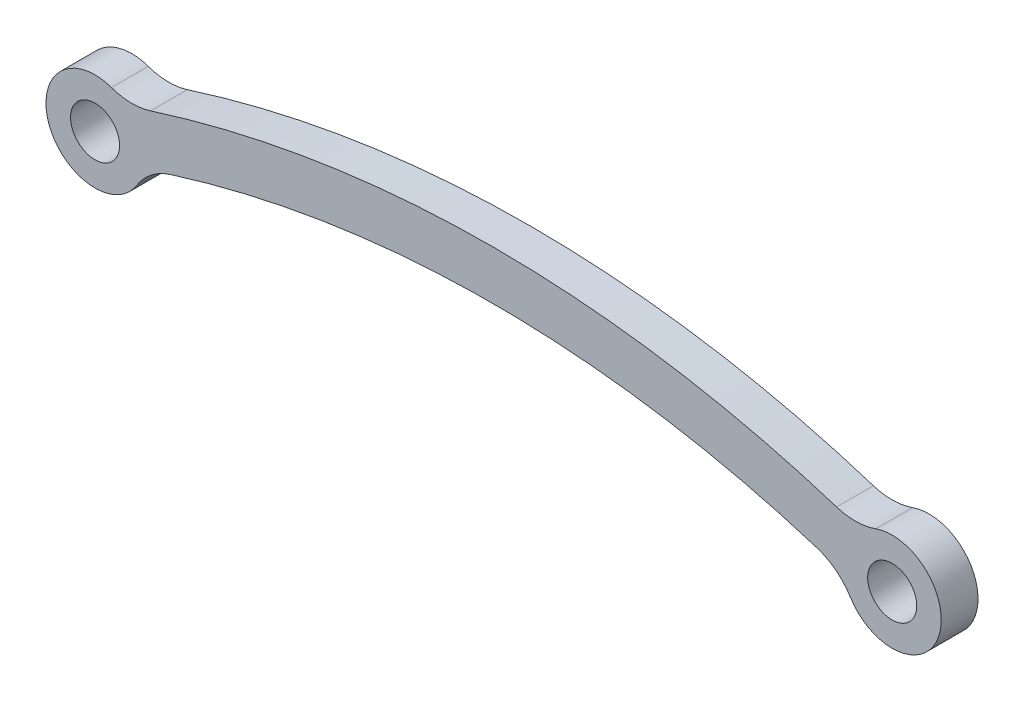
ISO-10303-21;
HEADER;
FILE_DESCRIPTION(('STEP AP214'),'2;1');
FILE_NAME('part.step','',(''),(''),'','','');
FILE_SCHEMA(('AUTOMOTIVE_DESIGN { 1 0 10303 214 1 1 1 1 }'));
ENDSEC;
DATA;
#1=APPLICATION_CONTEXT('core data for automotive mechanical design processes');
#2=APPLICATION_PROTOCOL_DEFINITION('international standard','automotive_design',2000,#1);
#3=PRODUCT_CONTEXT('',#1,'mechanical');
#4=PRODUCT('Part','Part','',(#3));
#5=PRODUCT_RELATED_PRODUCT_CATEGORY('part','',(#4));
#6=PRODUCT_DEFINITION_FORMATION('','',#4);
#7=PRODUCT_DEFINITION_CONTEXT('part definition',#1,'design');
#8=PRODUCT_DEFINITION('design','',#6,#7);
#9=PRODUCT_DEFINITION_SHAPE('','',#8);
#10=(LENGTH_UNIT() NAMED_UNIT(*) SI_UNIT(.MILLI.,.METRE.));
#11=(NAMED_UNIT(*) PLANE_ANGLE_UNIT() SI_UNIT($,.RADIAN.));
#12=(NAMED_UNIT(*) SI_UNIT($,.STERADIAN.) SOLID_ANGLE_UNIT());
#13=UNCERTAINTY_MEASURE_WITH_UNIT(LENGTH_MEASURE(1.E-05),#10,'distance_accuracy_value','');
#14=(GEOMETRIC_REPRESENTATION_CONTEXT(3) GLOBAL_UNCERTAINTY_ASSIGNED_CONTEXT((#13)) GLOBAL_UNIT_ASSIGNED_CONTEXT((#10,
#11,#12)) REPRESENTATION_CONTEXT('',''));
#15=CARTESIAN_POINT('',(0.,0.,0.));
#16=DIRECTION('',(0.,0.,1.));
#17=DIRECTION('',(1.,0.,0.));
#18=AXIS2_PLACEMENT_3D('',#15,#16,#17);
#19=CARTESIAN_POINT('',(0.,0.,6.));
#20=DIRECTION('',(0.,0.,1.));
#21=DIRECTION('',(1.,0.,0.));
#22=AXIS2_PLACEMENT_3D('',#19,#20,#21);
#23=PLANE('',#22);
#24=CARTESIAN_POINT('',(-65.,0.,6.));
#25=DIRECTION('',(0.,0.,1.));
#26=DIRECTION('',(1.,0.,0.));
#27=AXIS2_PLACEMENT_3D('',#24,#25,#26);
#28=CIRCLE('',#27,4.00000000000001);
#29=CARTESIAN_POINT('',(-61.,0.,6.));
#30=VERTEX_POINT('',#29);
#31=EDGE_CURVE('E176',#30,#30,#28,.T.);
#32=ORIENTED_EDGE('',*,*,#31,.F.);
#33=EDGE_LOOP('',(#32));
#34=FACE_BOUND('',#33,.T.);
#35=CARTESIAN_POINT('',(65.,0.,6.));
#36=DIRECTION('',(0.,0.,1.));
#37=DIRECTION('',(1.,0.,0.));
#38=AXIS2_PLACEMENT_3D('',#35,#36,#37);
#39=CIRCLE('',#38,4.00000000000001);
#40=CARTESIAN_POINT('',(69.,0.,6.));
#41=VERTEX_POINT('',#40);
#42=EDGE_CURVE('E162',#41,#41,#39,.T.);
#43=ORIENTED_EDGE('',*,*,#42,.F.);
#44=EDGE_LOOP('',(#43));
#45=FACE_BOUND('',#44,.T.);
#46=CARTESIAN_POINT('',(0.,-167.854103315945,6.));
#47=DIRECTION('',(0.,0.,1.));
#48=DIRECTION('',(1.,0.,0.));
#49=AXIS2_PLACEMENT_3D('',#46,#47,#48);
#50=CIRCLE('',#49,184.);
#51=CARTESIAN_POINT('',(-55.9391127026411,7.43655721690012,6.));
#52=VERTEX_POINT('',#51);
#53=CARTESIAN_POINT('',(55.939112702641,7.43655721690015,6.));
#54=VERTEX_POINT('',#53);
#55=EDGE_CURVE('E111',#52,#54,#50,.F.);
#56=ORIENTED_EDGE('',*,*,#55,.F.);
#57=CARTESIAN_POINT('',(-58.979281871263,16.9632235502069,6.));
#58=DIRECTION('',(0.,0.,1.));
#59=DIRECTION('',(1.,0.,0.));
#60=AXIS2_PLACEMENT_3D('',#57,#58,#59);
#61=CIRCLE('',#60,10.);
#62=CARTESIAN_POINT('',(-62.3241252761168,7.53921046675865,6.));
#63=VERTEX_POINT('',#62);
#64=EDGE_CURVE('E58',#52,#63,#61,.F.);
#65=ORIENTED_EDGE('',*,*,#64,.T.);
#66=CARTESIAN_POINT('',(-65.,0.,6.));
#67=DIRECTION('',(0.,0.,1.));
#68=DIRECTION('',(1.,0.,0.));
#69=AXIS2_PLACEMENT_3D('',#66,#67,#68);
#70=CIRCLE('',#69,8.);
#71=CARTESIAN_POINT('',(-58.1954569639986,-4.20692216129623,6.));
#72=VERTEX_POINT('',#71);
#73=EDGE_CURVE('E101',#63,#72,#70,.T.);
#74=ORIENTED_EDGE('',*,*,#73,.T.);
#75=CARTESIAN_POINT('',(-49.6897781689969,-9.46557486291651,6.));
#76=DIRECTION('',(0.,0.,1.));
#77=DIRECTION('',(1.,0.,0.));
#78=AXIS2_PLACEMENT_3D('',#75,#76,#77);
#79=CIRCLE('',#78,10.);
#80=CARTESIAN_POINT('',(-52.6831382996594,0.0759027547358182,6.));
#81=VERTEX_POINT('',#80);
#82=EDGE_CURVE('E44',#72,#81,#79,.F.);
#83=ORIENTED_EDGE('',*,*,#82,.T.);
#84=CARTESIAN_POINT('',(0.,-167.854103315945,6.));
#85=DIRECTION('',(0.,0.,1.));
#86=DIRECTION('',(1.,0.,0.));
#87=AXIS2_PLACEMENT_3D('',#84,#85,#86);
#88=CIRCLE('',#87,176.);
#89=CARTESIAN_POINT('',(52.6831382996594,0.075902754735846,6.));
#90=VERTEX_POINT('',#89);
#91=EDGE_CURVE('E100',#81,#90,#88,.F.);
#92=ORIENTED_EDGE('',*,*,#91,.T.);
#93=CARTESIAN_POINT('',(49.6897781689969,-9.46557486291651,6.));
#94=DIRECTION('',(0.,0.,1.));
#95=DIRECTION('',(1.,0.,0.));
#96=AXIS2_PLACEMENT_3D('',#93,#94,#95);
#97=CIRCLE('',#96,10.);
#98=CARTESIAN_POINT('',(58.1954569639986,-4.20692216129623,6.));
#99=VERTEX_POINT('',#98);
#100=EDGE_CURVE('E136',#90,#99,#97,.F.);
#101=ORIENTED_EDGE('',*,*,#100,.T.);
#102=CARTESIAN_POINT('',(65.,0.,6.));
#103=DIRECTION('',(0.,0.,1.));
#104=DIRECTION('',(1.,0.,0.));
#105=AXIS2_PLACEMENT_3D('',#102,#103,#104);
#106=CIRCLE('',#105,8.00000000000001);
#107=CARTESIAN_POINT('',(62.3241252761168,7.53921046675866,6.));
#108=VERTEX_POINT('',#107);
#109=EDGE_CURVE('E117',#99,#108,#106,.T.);
#110=ORIENTED_EDGE('',*,*,#109,.T.);
#111=CARTESIAN_POINT('',(58.9792818712628,16.963223550207,6.));
#112=DIRECTION('',(0.,0.,1.));
#113=DIRECTION('',(1.,0.,0.));
#114=AXIS2_PLACEMENT_3D('',#111,#112,#113);
#115=CIRCLE('',#114,10.);
#116=EDGE_CURVE('E140',#108,#54,#115,.F.);
#117=ORIENTED_EDGE('',*,*,#116,.T.);
#118=EDGE_LOOP('',(#56,#65,#74,#83,#92,#101,#110,#117));
#119=FACE_BOUND('',#118,.T.);
#120=ADVANCED_FACE('F36',(#34,#45,#119),#23,.T.);
#121=CARTESIAN_POINT('',(0.,0.,0.));
#122=DIRECTION('',(0.,0.,1.));
#123=DIRECTION('',(1.,0.,0.));
#124=AXIS2_PLACEMENT_3D('',#121,#122,#123);
#125=PLANE('',#124);
#126=CARTESIAN_POINT('',(65.,0.,0.));
#127=DIRECTION('',(0.,0.,1.));
#128=DIRECTION('',(1.,0.,0.));
#129=AXIS2_PLACEMENT_3D('',#126,#127,#128);
#130=CIRCLE('',#129,4.00000000000001);
#131=CARTESIAN_POINT('',(69.,0.,0.));
#132=VERTEX_POINT('',#131);
#133=EDGE_CURVE('E174',#132,#132,#130,.T.);
#134=ORIENTED_EDGE('',*,*,#133,.T.);
#135=EDGE_LOOP('',(#134));
#136=FACE_BOUND('',#135,.T.);
#137=CARTESIAN_POINT('',(-65.,0.,0.));
#138=DIRECTION('',(0.,0.,1.));
#139=DIRECTION('',(1.,0.,0.));
#140=AXIS2_PLACEMENT_3D('',#137,#138,#139);
#141=CIRCLE('',#140,4.00000000000001);
#142=CARTESIAN_POINT('',(-61.,0.,0.));
#143=VERTEX_POINT('',#142);
#144=EDGE_CURVE('E120',#143,#143,#141,.T.);
#145=ORIENTED_EDGE('',*,*,#144,.T.);
#146=EDGE_LOOP('',(#145));
#147=FACE_BOUND('',#146,.T.);
#148=CARTESIAN_POINT('',(0.,-167.854103315945,0.));
#149=DIRECTION('',(0.,0.,1.));
#150=DIRECTION('',(1.,0.,0.));
#151=AXIS2_PLACEMENT_3D('',#148,#149,#150);
#152=CIRCLE('',#151,176.);
#153=CARTESIAN_POINT('',(-52.6831382996594,0.0759027547358182,0.));
#154=VERTEX_POINT('',#153);
#155=CARTESIAN_POINT('',(52.6831382996594,0.075902754735846,0.));
#156=VERTEX_POINT('',#155);
#157=EDGE_CURVE('E163',#154,#156,#152,.F.);
#158=ORIENTED_EDGE('',*,*,#157,.F.);
#159=CARTESIAN_POINT('',(-49.6897781689969,-9.46557486291651,0.));
#160=DIRECTION('',(0.,0.,1.));
#161=DIRECTION('',(1.,0.,0.));
#162=AXIS2_PLACEMENT_3D('',#159,#160,#161);
#163=CIRCLE('',#162,10.);
#164=CARTESIAN_POINT('',(-58.1954569639986,-4.20692216129623,0.));
#165=VERTEX_POINT('',#164);
#166=EDGE_CURVE('E11',#154,#165,#163,.T.);
#167=ORIENTED_EDGE('',*,*,#166,.T.);
#168=CARTESIAN_POINT('',(-65.,0.,0.));
#169=DIRECTION('',(0.,0.,1.));
#170=DIRECTION('',(1.,0.,0.));
#171=AXIS2_PLACEMENT_3D('',#168,#169,#170);
#172=CIRCLE('',#171,8.);
#173=CARTESIAN_POINT('',(-62.3241252761168,7.53921046675865,0.));
#174=VERTEX_POINT('',#173);
#175=EDGE_CURVE('E154',#174,#165,#172,.T.);
#176=ORIENTED_EDGE('',*,*,#175,.F.);
#177=CARTESIAN_POINT('',(-58.979281871263,16.9632235502069,0.));
#178=DIRECTION('',(0.,0.,1.));
#179=DIRECTION('',(1.,0.,0.));
#180=AXIS2_PLACEMENT_3D('',#177,#178,#179);
#181=CIRCLE('',#180,10.);
#182=CARTESIAN_POINT('',(-55.9391127026411,7.43655721690012,0.));
#183=VERTEX_POINT('',#182);
#184=EDGE_CURVE('E102',#174,#183,#181,.T.);
#185=ORIENTED_EDGE('',*,*,#184,.T.);
#186=CARTESIAN_POINT('',(0.,-167.854103315945,0.));
#187=DIRECTION('',(0.,0.,1.));
#188=DIRECTION('',(1.,0.,0.));
#189=AXIS2_PLACEMENT_3D('',#186,#187,#188);
#190=CIRCLE('',#189,184.);
#191=CARTESIAN_POINT('',(55.939112702641,7.43655721690015,0.));
#192=VERTEX_POINT('',#191);
#193=EDGE_CURVE('E151',#183,#192,#190,.F.);
#194=ORIENTED_EDGE('',*,*,#193,.T.);
#195=CARTESIAN_POINT('',(58.9792818712628,16.963223550207,0.));
#196=DIRECTION('',(0.,0.,1.));
#197=DIRECTION('',(1.,0.,0.));
#198=AXIS2_PLACEMENT_3D('',#195,#196,#197);
#199=CIRCLE('',#198,10.);
#200=CARTESIAN_POINT('',(62.3241252761168,7.53921046675866,0.));
#201=VERTEX_POINT('',#200);
#202=EDGE_CURVE('E142',#192,#201,#199,.T.);
#203=ORIENTED_EDGE('',*,*,#202,.T.);
#204=CARTESIAN_POINT('',(65.,0.,0.));
#205=DIRECTION('',(0.,0.,1.));
#206=DIRECTION('',(1.,0.,0.));
#207=AXIS2_PLACEMENT_3D('',#204,#205,#206);
#208=CIRCLE('',#207,8.00000000000001);
#209=CARTESIAN_POINT('',(58.1954569639986,-4.20692216129623,0.));
#210=VERTEX_POINT('',#209);
#211=EDGE_CURVE('E168',#210,#201,#208,.T.);
#212=ORIENTED_EDGE('',*,*,#211,.F.);
#213=CARTESIAN_POINT('',(49.6897781689969,-9.46557486291651,0.));
#214=DIRECTION('',(0.,0.,1.));
#215=DIRECTION('',(1.,0.,0.));
#216=AXIS2_PLACEMENT_3D('',#213,#214,#215);
#217=CIRCLE('',#216,10.);
#218=EDGE_CURVE('E138',#210,#156,#217,.T.);
#219=ORIENTED_EDGE('',*,*,#218,.T.);
#220=EDGE_LOOP('',(#158,#167,#176,#185,#194,#203,#212,#219));
#221=FACE_BOUND('',#220,.T.);
#222=ADVANCED_FACE('F150',(#136,#147,#221),#125,.F.);
#223=CARTESIAN_POINT('',(65.,0.,6.));
#224=DIRECTION('',(0.,0.,-1.));
#225=DIRECTION('',(-1.,0.,0.));
#226=AXIS2_PLACEMENT_3D('',#223,#224,#225);
#227=CYLINDRICAL_SURFACE('',#226,8.00000000000001);
#228=ORIENTED_EDGE('',*,*,#109,.F.);
#229=DIRECTION('',(0.,0.,-1.));
#230=VECTOR('',#229,1.);
#231=CARTESIAN_POINT('',(58.1954569639986,-4.20692216129623,6.));
#232=LINE('',#231,#230);
#233=EDGE_CURVE('E125',#99,#210,#232,.T.);
#234=ORIENTED_EDGE('',*,*,#233,.T.);
#235=ORIENTED_EDGE('',*,*,#211,.T.);
#236=DIRECTION('',(0.,0.,-1.));
#237=VECTOR('',#236,1.);
#238=CARTESIAN_POINT('',(62.3241252761168,7.53921046675866,6.));
#239=LINE('',#238,#237);
#240=EDGE_CURVE('E115',#201,#108,#239,.F.);
#241=ORIENTED_EDGE('',*,*,#240,.T.);
#242=EDGE_LOOP('',(#228,#234,#235,#241));
#243=FACE_BOUND('',#242,.T.);
#244=ADVANCED_FACE('F194',(#243),#227,.T.);
#245=CARTESIAN_POINT('',(-65.,0.,6.));
#246=DIRECTION('',(0.,0.,-1.));
#247=DIRECTION('',(-1.,0.,0.));
#248=AXIS2_PLACEMENT_3D('',#245,#246,#247);
#249=CYLINDRICAL_SURFACE('',#248,8.);
#250=ORIENTED_EDGE('',*,*,#73,.F.);
#251=DIRECTION('',(0.,0.,-1.));
#252=VECTOR('',#251,1.);
#253=CARTESIAN_POINT('',(-62.3241252761169,7.53921046675867,6.));
#254=LINE('',#253,#252);
#255=EDGE_CURVE('E134',#63,#174,#254,.T.);
#256=ORIENTED_EDGE('',*,*,#255,.T.);
#257=ORIENTED_EDGE('',*,*,#175,.T.);
#258=DIRECTION('',(0.,0.,-1.));
#259=VECTOR('',#258,1.);
#260=CARTESIAN_POINT('',(-58.1954569639986,-4.20692216129623,6.));
#261=LINE('',#260,#259);
#262=EDGE_CURVE('E132',#165,#72,#261,.F.);
#263=ORIENTED_EDGE('',*,*,#262,.T.);
#264=EDGE_LOOP('',(#250,#256,#257,#263));
#265=FACE_BOUND('',#264,.T.);
#266=ADVANCED_FACE('F167',(#265),#249,.T.);
#267=CARTESIAN_POINT('',(65.,0.,-9.));
#268=DIRECTION('',(0.,0.,1.));
#269=DIRECTION('',(1.,0.,0.));
#270=AXIS2_PLACEMENT_3D('',#267,#268,#269);
#271=CYLINDRICAL_SURFACE('',#270,4.00000000000001);
#272=ORIENTED_EDGE('',*,*,#42,.T.);
#273=EDGE_LOOP('',(#272));
#274=FACE_BOUND('',#273,.T.);
#275=ORIENTED_EDGE('',*,*,#133,.F.);
#276=EDGE_LOOP('',(#275));
#277=FACE_BOUND('',#276,.T.);
#278=ADVANCED_FACE('F215',(#274,#277),#271,.F.);
#279=CARTESIAN_POINT('',(-65.,0.,-9.));
#280=DIRECTION('',(0.,0.,1.));
#281=DIRECTION('',(1.,0.,0.));
#282=AXIS2_PLACEMENT_3D('',#279,#280,#281);
#283=CYLINDRICAL_SURFACE('',#282,4.00000000000001);
#284=ORIENTED_EDGE('',*,*,#31,.T.);
#285=EDGE_LOOP('',(#284));
#286=FACE_BOUND('',#285,.T.);
#287=ORIENTED_EDGE('',*,*,#144,.F.);
#288=EDGE_LOOP('',(#287));
#289=FACE_BOUND('',#288,.T.);
#290=ADVANCED_FACE('F236',(#286,#289),#283,.F.);
#291=CARTESIAN_POINT('',(0.,-167.854103315945,0.));
#292=DIRECTION('',(0.,0.,1.));
#293=DIRECTION('',(1.,0.,0.));
#294=AXIS2_PLACEMENT_3D('',#291,#292,#293);
#295=CYLINDRICAL_SURFACE('',#294,184.);
#296=ORIENTED_EDGE('',*,*,#55,.T.);
#297=DIRECTION('',(0.,0.,1.));
#298=VECTOR('',#297,1.);
#299=CARTESIAN_POINT('',(55.939112702641,7.43655721690015,0.));
#300=LINE('',#299,#298);
#301=EDGE_CURVE('E130',#54,#192,#300,.F.);
#302=ORIENTED_EDGE('',*,*,#301,.T.);
#303=ORIENTED_EDGE('',*,*,#193,.F.);
#304=DIRECTION('',(0.,0.,1.));
#305=VECTOR('',#304,1.);
#306=CARTESIAN_POINT('',(-55.9391127026412,7.43655721690009,0.));
#307=LINE('',#306,#305);
#308=EDGE_CURVE('E127',#183,#52,#307,.T.);
#309=ORIENTED_EDGE('',*,*,#308,.T.);
#310=EDGE_LOOP('',(#296,#302,#303,#309));
#311=FACE_BOUND('',#310,.T.);
#312=ADVANCED_FACE('F160',(#311),#295,.T.);
#313=CARTESIAN_POINT('',(0.,-167.854103315945,0.));
#314=DIRECTION('',(0.,0.,1.));
#315=DIRECTION('',(1.,0.,0.));
#316=AXIS2_PLACEMENT_3D('',#313,#314,#315);
#317=CYLINDRICAL_SURFACE('',#316,176.);
#318=ORIENTED_EDGE('',*,*,#157,.T.);
#319=DIRECTION('',(0.,0.,1.));
#320=VECTOR('',#319,1.);
#321=CARTESIAN_POINT('',(52.6831382996594,0.0759027547358737,0.));
#322=LINE('',#321,#320);
#323=EDGE_CURVE('E110',#156,#90,#322,.T.);
#324=ORIENTED_EDGE('',*,*,#323,.T.);
#325=ORIENTED_EDGE('',*,*,#91,.F.);
#326=DIRECTION('',(0.,0.,1.));
#327=VECTOR('',#326,1.);
#328=CARTESIAN_POINT('',(-52.6831382996594,0.0759027547358182,0.));
#329=LINE('',#328,#327);
#330=EDGE_CURVE('E107',#81,#154,#329,.F.);
#331=ORIENTED_EDGE('',*,*,#330,.T.);
#332=EDGE_LOOP('',(#318,#324,#325,#331));
#333=FACE_BOUND('',#332,.T.);
#334=ADVANCED_FACE('F106',(#333),#317,.F.);
#335=CARTESIAN_POINT('',(49.6897781689969,-9.46557486291651,6.));
#336=DIRECTION('',(0.,0.,1.));
#337=DIRECTION('',(1.,0.,0.));
#338=AXIS2_PLACEMENT_3D('',#335,#336,#337);
#339=CYLINDRICAL_SURFACE('',#338,10.);
#340=ORIENTED_EDGE('',*,*,#218,.F.);
#341=ORIENTED_EDGE('',*,*,#233,.F.);
#342=ORIENTED_EDGE('',*,*,#100,.F.);
#343=ORIENTED_EDGE('',*,*,#323,.F.);
#344=EDGE_LOOP('',(#340,#341,#342,#343));
#345=FACE_BOUND('',#344,.T.);
#346=ADVANCED_FACE('F190',(#345),#339,.F.);
#347=CARTESIAN_POINT('',(58.9792818712628,16.963223550207,0.));
#348=DIRECTION('',(0.,0.,-1.));
#349=DIRECTION('',(-1.,0.,0.));
#350=AXIS2_PLACEMENT_3D('',#347,#348,#349);
#351=CYLINDRICAL_SURFACE('',#350,10.);
#352=ORIENTED_EDGE('',*,*,#202,.F.);
#353=ORIENTED_EDGE('',*,*,#301,.F.);
#354=ORIENTED_EDGE('',*,*,#116,.F.);
#355=ORIENTED_EDGE('',*,*,#240,.F.);
#356=EDGE_LOOP('',(#352,#353,#354,#355));
#357=FACE_BOUND('',#356,.T.);
#358=ADVANCED_FACE('F198',(#357),#351,.F.);
#359=CARTESIAN_POINT('',(-58.979281871263,16.9632235502069,6.));
#360=DIRECTION('',(0.,0.,-1.));
#361=DIRECTION('',(-1.,0.,0.));
#362=AXIS2_PLACEMENT_3D('',#359,#360,#361);
#363=CYLINDRICAL_SURFACE('',#362,10.);
#364=ORIENTED_EDGE('',*,*,#184,.F.);
#365=ORIENTED_EDGE('',*,*,#255,.F.);
#366=ORIENTED_EDGE('',*,*,#64,.F.);
#367=ORIENTED_EDGE('',*,*,#308,.F.);
#368=EDGE_LOOP('',(#364,#365,#366,#367));
#369=FACE_BOUND('',#368,.T.);
#370=ADVANCED_FACE('F165',(#369),#363,.F.);
#371=CARTESIAN_POINT('',(-49.6897781689969,-9.46557486291651,0.));
#372=DIRECTION('',(0.,0.,1.));
#373=DIRECTION('',(1.,0.,0.));
#374=AXIS2_PLACEMENT_3D('',#371,#372,#373);
#375=CYLINDRICAL_SURFACE('',#374,10.);
#376=ORIENTED_EDGE('',*,*,#166,.F.);
#377=ORIENTED_EDGE('',*,*,#330,.F.);
#378=ORIENTED_EDGE('',*,*,#82,.F.);
#379=ORIENTED_EDGE('',*,*,#262,.F.);
#380=EDGE_LOOP('',(#376,#377,#378,#379));
#381=FACE_BOUND('',#380,.T.);
#382=ADVANCED_FACE('F38',(#381),#375,.F.);
#383=CLOSED_SHELL('',(#120,#222,#244,#266,#278,#290,#312,#334,#346,#358,#370,#382));
#384=MANIFOLD_SOLID_BREP('B2',#383);
#385=ADVANCED_BREP_SHAPE_REPRESENTATION('',(#18,#384),#14);
#386=SHAPE_DEFINITION_REPRESENTATION(#9,#385);
ENDSEC;
END-ISO-10303-21;
